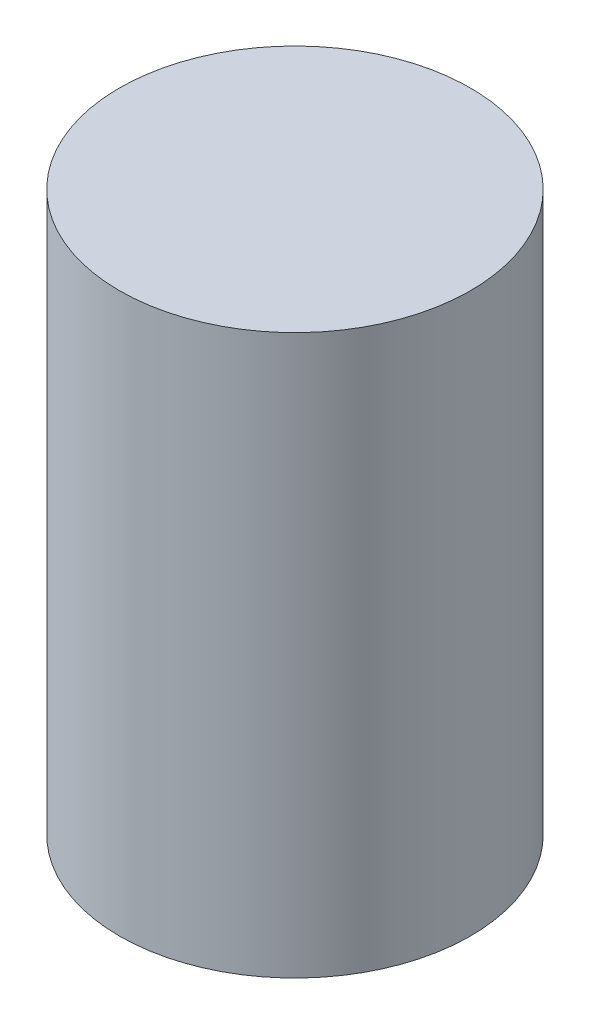
ISO-10303-21;
HEADER;
FILE_DESCRIPTION(('STEP AP214'),'2;1');
FILE_NAME('part.step','',(''),(''),'','','');
FILE_SCHEMA(('AUTOMOTIVE_DESIGN { 1 0 10303 214 1 1 1 1 }'));
ENDSEC;
DATA;
#1=APPLICATION_CONTEXT('core data for automotive mechanical design processes');
#2=APPLICATION_PROTOCOL_DEFINITION('international standard','automotive_design',2000,#1);
#3=PRODUCT_CONTEXT('',#1,'mechanical');
#4=PRODUCT('Part','Part','',(#3));
#5=PRODUCT_RELATED_PRODUCT_CATEGORY('part','',(#4));
#6=PRODUCT_DEFINITION_FORMATION('','',#4);
#7=PRODUCT_DEFINITION_CONTEXT('part definition',#1,'design');
#8=PRODUCT_DEFINITION('design','',#6,#7);
#9=PRODUCT_DEFINITION_SHAPE('','',#8);
#10=(LENGTH_UNIT() NAMED_UNIT(*) SI_UNIT(.MILLI.,.METRE.));
#11=(NAMED_UNIT(*) PLANE_ANGLE_UNIT() SI_UNIT($,.RADIAN.));
#12=(NAMED_UNIT(*) SI_UNIT($,.STERADIAN.) SOLID_ANGLE_UNIT());
#13=UNCERTAINTY_MEASURE_WITH_UNIT(LENGTH_MEASURE(1.E-05),#10,'distance_accuracy_value','');
#14=(GEOMETRIC_REPRESENTATION_CONTEXT(3) GLOBAL_UNCERTAINTY_ASSIGNED_CONTEXT((#13)) GLOBAL_UNIT_ASSIGNED_CONTEXT((#10,
#11,#12)) REPRESENTATION_CONTEXT('',''));
#15=CARTESIAN_POINT('',(0.,0.,0.));
#16=DIRECTION('',(0.,0.,1.));
#17=DIRECTION('',(1.,0.,0.));
#18=AXIS2_PLACEMENT_3D('',#15,#16,#17);
#19=CARTESIAN_POINT('',(0.,1270.,0.));
#20=DIRECTION('',(0.,-1.,0.));
#21=DIRECTION('',(0.,0.,-1.));
#22=AXIS2_PLACEMENT_3D('',#19,#20,#21);
#23=CYLINDRICAL_SURFACE('',#22,797.687);
#24=CARTESIAN_POINT('',(0.,1270.,0.));
#25=DIRECTION('',(0.,1.,0.));
#26=DIRECTION('',(0.,0.,1.));
#27=AXIS2_PLACEMENT_3D('',#24,#25,#26);
#28=CIRCLE('',#27,797.687);
#29=CARTESIAN_POINT('',(0.,1270.,797.687));
#30=VERTEX_POINT('',#29);
#31=EDGE_CURVE('E10',#30,#30,#28,.T.);
#32=ORIENTED_EDGE('',*,*,#31,.F.);
#33=EDGE_LOOP('',(#32));
#34=FACE_BOUND('',#33,.T.);
#35=CARTESIAN_POINT('',(0.,-1270.,0.));
#36=DIRECTION('',(0.,1.,0.));
#37=DIRECTION('',(0.,0.,1.));
#38=AXIS2_PLACEMENT_3D('',#35,#36,#37);
#39=CIRCLE('',#38,797.687);
#40=CARTESIAN_POINT('',(0.,-1270.,797.687));
#41=VERTEX_POINT('',#40);
#42=EDGE_CURVE('E31',#41,#41,#39,.T.);
#43=ORIENTED_EDGE('',*,*,#42,.T.);
#44=EDGE_LOOP('',(#43));
#45=FACE_BOUND('',#44,.T.);
#46=ADVANCED_FACE('F28',(#34,#45),#23,.T.);
#47=CARTESIAN_POINT('',(0.,1270.,0.));
#48=DIRECTION('',(0.,1.,0.));
#49=DIRECTION('',(0.,0.,1.));
#50=AXIS2_PLACEMENT_3D('',#47,#48,#49);
#51=PLANE('',#50);
#52=ORIENTED_EDGE('',*,*,#31,.T.);
#53=EDGE_LOOP('',(#52));
#54=FACE_BOUND('',#53,.T.);
#55=ADVANCED_FACE('F43',(#54),#51,.T.);
#56=CARTESIAN_POINT('',(0.,-1270.,0.));
#57=DIRECTION('',(0.,1.,0.));
#58=DIRECTION('',(0.,0.,1.));
#59=AXIS2_PLACEMENT_3D('',#56,#57,#58);
#60=PLANE('',#59);
#61=ORIENTED_EDGE('',*,*,#42,.F.);
#62=EDGE_LOOP('',(#61));
#63=FACE_BOUND('',#62,.T.);
#64=ADVANCED_FACE('F41',(#63),#60,.F.);
#65=CLOSED_SHELL('',(#46,#55,#64));
#66=MANIFOLD_SOLID_BREP('B2',#65);
#67=ADVANCED_BREP_SHAPE_REPRESENTATION('',(#18,#66),#14);
#68=SHAPE_DEFINITION_REPRESENTATION(#9,#67);
ENDSEC;
END-ISO-10303-21;
